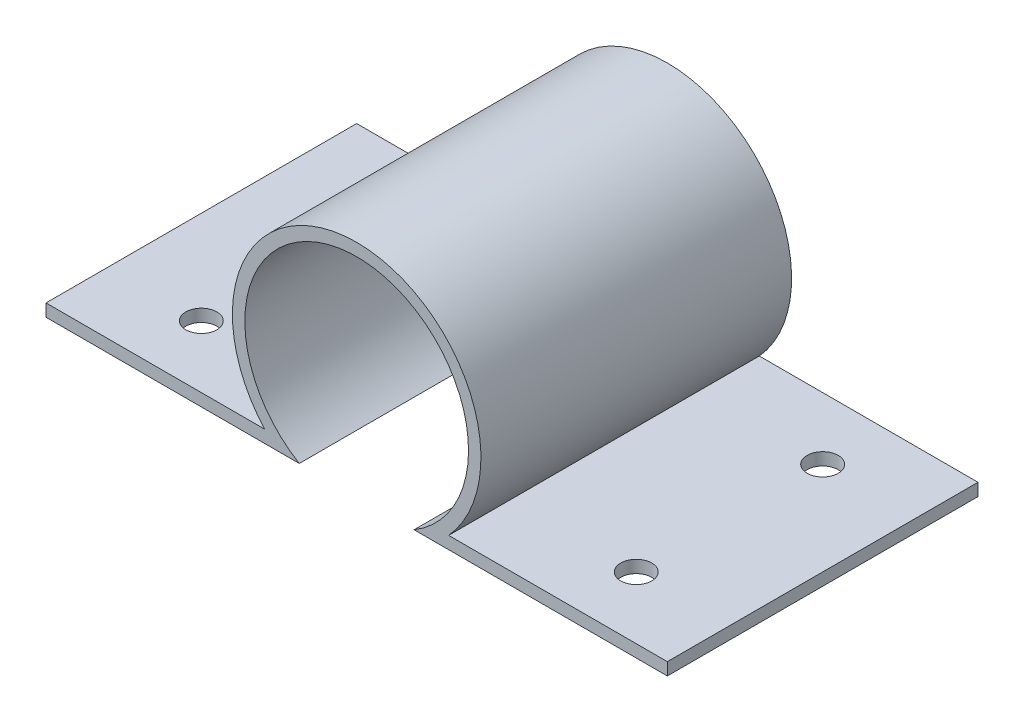
ISO-10303-21;
HEADER;
FILE_DESCRIPTION(('STEP AP214'),'2;1');
FILE_NAME('part.step','',(''),(''),'','','');
FILE_SCHEMA(('AUTOMOTIVE_DESIGN { 1 0 10303 214 1 1 1 1 }'));
ENDSEC;
DATA;
#1=APPLICATION_CONTEXT('core data for automotive mechanical design processes');
#2=APPLICATION_PROTOCOL_DEFINITION('international standard','automotive_design',2000,#1);
#3=PRODUCT_CONTEXT('',#1,'mechanical');
#4=PRODUCT('Part','Part','',(#3));
#5=PRODUCT_RELATED_PRODUCT_CATEGORY('part','',(#4));
#6=PRODUCT_DEFINITION_FORMATION('','',#4);
#7=PRODUCT_DEFINITION_CONTEXT('part definition',#1,'design');
#8=PRODUCT_DEFINITION('design','',#6,#7);
#9=PRODUCT_DEFINITION_SHAPE('','',#8);
#10=(LENGTH_UNIT() NAMED_UNIT(*) SI_UNIT(.MILLI.,.METRE.));
#11=(NAMED_UNIT(*) PLANE_ANGLE_UNIT() SI_UNIT($,.RADIAN.));
#12=(NAMED_UNIT(*) SI_UNIT($,.STERADIAN.) SOLID_ANGLE_UNIT());
#13=UNCERTAINTY_MEASURE_WITH_UNIT(LENGTH_MEASURE(1.E-05),#10,'distance_accuracy_value','');
#14=(GEOMETRIC_REPRESENTATION_CONTEXT(3) GLOBAL_UNCERTAINTY_ASSIGNED_CONTEXT((#13)) GLOBAL_UNIT_ASSIGNED_CONTEXT((#10,
#11,#12)) REPRESENTATION_CONTEXT('',''));
#15=CARTESIAN_POINT('',(0.,0.,0.));
#16=DIRECTION('',(0.,0.,1.));
#17=DIRECTION('',(1.,0.,0.));
#18=AXIS2_PLACEMENT_3D('',#15,#16,#17);
#19=CARTESIAN_POINT('',(-50.,0.,50.));
#20=DIRECTION('',(1.,0.,0.));
#21=DIRECTION('',(0.,0.,-1.));
#22=AXIS2_PLACEMENT_3D('',#19,#20,#21);
#23=PLANE('',#22);
#24=DIRECTION('',(0.,-1.,0.));
#25=VECTOR('',#24,1.);
#26=CARTESIAN_POINT('',(-50.,0.,0.));
#27=LINE('',#26,#25);
#28=CARTESIAN_POINT('',(-50.,0.,0.));
#29=VERTEX_POINT('',#28);
#30=CARTESIAN_POINT('',(-50.,-2.,0.));
#31=VERTEX_POINT('',#30);
#32=EDGE_CURVE('E140',#29,#31,#27,.T.);
#33=ORIENTED_EDGE('',*,*,#32,.T.);
#34=DIRECTION('',(0.,0.,-1.));
#35=VECTOR('',#34,1.);
#36=CARTESIAN_POINT('',(-50.,-2.,50.));
#37=LINE('',#36,#35);
#38=CARTESIAN_POINT('',(-50.,-2.,50.));
#39=VERTEX_POINT('',#38);
#40=EDGE_CURVE('E11',#39,#31,#37,.T.);
#41=ORIENTED_EDGE('',*,*,#40,.F.);
#42=DIRECTION('',(0.,-1.,0.));
#43=VECTOR('',#42,1.);
#44=CARTESIAN_POINT('',(-50.,0.,50.));
#45=LINE('',#44,#43);
#46=CARTESIAN_POINT('',(-50.,0.,50.));
#47=VERTEX_POINT('',#46);
#48=EDGE_CURVE('E163',#47,#39,#45,.T.);
#49=ORIENTED_EDGE('',*,*,#48,.F.);
#50=DIRECTION('',(0.,0.,-1.));
#51=VECTOR('',#50,1.);
#52=CARTESIAN_POINT('',(-50.,0.,50.));
#53=LINE('',#52,#51);
#54=EDGE_CURVE('E136',#47,#29,#53,.T.);
#55=ORIENTED_EDGE('',*,*,#54,.T.);
#56=EDGE_LOOP('',(#33,#41,#49,#55));
#57=FACE_BOUND('',#56,.T.);
#58=ADVANCED_FACE('F39',(#57),#23,.F.);
#59=CARTESIAN_POINT('',(-50.,-2.,50.));
#60=DIRECTION('',(0.,1.,0.));
#61=DIRECTION('',(-1.,0.,0.));
#62=AXIS2_PLACEMENT_3D('',#59,#60,#61);
#63=PLANE('',#62);
#64=CARTESIAN_POINT('',(-35.,-2.,10.));
#65=DIRECTION('',(0.,1.,0.));
#66=DIRECTION('',(-1.,0.,0.));
#67=AXIS2_PLACEMENT_3D('',#64,#65,#66);
#68=CIRCLE('',#67,2.5);
#69=CARTESIAN_POINT('',(-37.5,-2.,10.));
#70=VERTEX_POINT('',#69);
#71=EDGE_CURVE('E214',#70,#70,#68,.T.);
#72=ORIENTED_EDGE('',*,*,#71,.T.);
#73=EDGE_LOOP('',(#72));
#74=FACE_BOUND('',#73,.T.);
#75=CARTESIAN_POINT('',(-35.,-2.,40.));
#76=DIRECTION('',(0.,1.,0.));
#77=DIRECTION('',(-1.,0.,0.));
#78=AXIS2_PLACEMENT_3D('',#75,#76,#77);
#79=CIRCLE('',#78,2.5);
#80=CARTESIAN_POINT('',(-37.5,-2.,40.));
#81=VERTEX_POINT('',#80);
#82=EDGE_CURVE('E218',#81,#81,#79,.T.);
#83=ORIENTED_EDGE('',*,*,#82,.T.);
#84=EDGE_LOOP('',(#83));
#85=FACE_BOUND('',#84,.T.);
#86=DIRECTION('',(1.,0.,0.));
#87=VECTOR('',#86,1.);
#88=CARTESIAN_POINT('',(-50.,-2.,0.));
#89=LINE('',#88,#87);
#90=CARTESIAN_POINT('',(-9.23825219636957,-1.99999999999999,0.));
#91=VERTEX_POINT('',#90);
#92=EDGE_CURVE('E144',#31,#91,#89,.T.);
#93=ORIENTED_EDGE('',*,*,#92,.T.);
#94=DIRECTION('',(0.,0.,-1.));
#95=VECTOR('',#94,1.);
#96=CARTESIAN_POINT('',(-9.23825219636957,-1.99999999999999,50.));
#97=LINE('',#96,#95);
#98=CARTESIAN_POINT('',(-9.23825219636957,-1.99999999999999,50.));
#99=VERTEX_POINT('',#98);
#100=EDGE_CURVE('E48',#99,#91,#97,.T.);
#101=ORIENTED_EDGE('',*,*,#100,.F.);
#102=DIRECTION('',(1.,0.,0.));
#103=VECTOR('',#102,1.);
#104=CARTESIAN_POINT('',(-50.,-2.,50.));
#105=LINE('',#104,#103);
#106=EDGE_CURVE('E99',#39,#99,#105,.T.);
#107=ORIENTED_EDGE('',*,*,#106,.F.);
#108=ORIENTED_EDGE('',*,*,#40,.T.);
#109=EDGE_LOOP('',(#93,#101,#107,#108));
#110=FACE_BOUND('',#109,.T.);
#111=ADVANCED_FACE('F262',(#74,#85,#110),#63,.F.);
#112=CARTESIAN_POINT('',(0.,13.4484528790514,50.));
#113=DIRECTION('',(0.,0.,-1.));
#114=DIRECTION('',(-1.,0.,0.));
#115=AXIS2_PLACEMENT_3D('',#112,#113,#114);
#116=CYLINDRICAL_SURFACE('',#115,18.);
#117=CARTESIAN_POINT('',(0.,13.4484528790514,0.));
#118=DIRECTION('',(0.,0.,-1.));
#119=DIRECTION('',(1.,0.,0.));
#120=AXIS2_PLACEMENT_3D('',#117,#118,#119);
#121=CIRCLE('',#120,18.);
#122=CARTESIAN_POINT('',(9.23825219636958,-2.,0.));
#123=VERTEX_POINT('',#122);
#124=EDGE_CURVE('E148',#91,#123,#121,.T.);
#125=ORIENTED_EDGE('',*,*,#124,.T.);
#126=DIRECTION('',(0.,0.,-1.));
#127=VECTOR('',#126,1.);
#128=CARTESIAN_POINT('',(9.23825219636958,-2.,50.));
#129=LINE('',#128,#127);
#130=CARTESIAN_POINT('',(9.23825219636958,-2.,50.));
#131=VERTEX_POINT('',#130);
#132=EDGE_CURVE('E174',#131,#123,#129,.T.);
#133=ORIENTED_EDGE('',*,*,#132,.F.);
#134=CARTESIAN_POINT('',(0.,13.4484528790514,50.));
#135=DIRECTION('',(0.,0.,-1.));
#136=DIRECTION('',(1.,0.,0.));
#137=AXIS2_PLACEMENT_3D('',#134,#135,#136);
#138=CIRCLE('',#137,18.);
#139=EDGE_CURVE('E184',#99,#131,#138,.T.);
#140=ORIENTED_EDGE('',*,*,#139,.F.);
#141=ORIENTED_EDGE('',*,*,#100,.T.);
#142=EDGE_LOOP('',(#125,#133,#140,#141));
#143=FACE_BOUND('',#142,.T.);
#144=ADVANCED_FACE('F182',(#143),#116,.F.);
#145=CARTESIAN_POINT('',(9.23825219636958,-2.,50.));
#146=DIRECTION('',(0.,1.,0.));
#147=DIRECTION('',(-1.,0.,0.));
#148=AXIS2_PLACEMENT_3D('',#145,#146,#147);
#149=PLANE('',#148);
#150=CARTESIAN_POINT('',(35.,-1.99999999999999,40.));
#151=DIRECTION('',(0.,1.,0.));
#152=DIRECTION('',(-1.,0.,0.));
#153=AXIS2_PLACEMENT_3D('',#150,#151,#152);
#154=CIRCLE('',#153,2.5);
#155=CARTESIAN_POINT('',(32.5,-1.99999999999999,40.));
#156=VERTEX_POINT('',#155);
#157=EDGE_CURVE('E145',#156,#156,#154,.T.);
#158=ORIENTED_EDGE('',*,*,#157,.T.);
#159=EDGE_LOOP('',(#158));
#160=FACE_BOUND('',#159,.T.);
#161=CARTESIAN_POINT('',(35.,-1.99999999999999,10.));
#162=DIRECTION('',(0.,1.,0.));
#163=DIRECTION('',(-1.,0.,0.));
#164=AXIS2_PLACEMENT_3D('',#161,#162,#163);
#165=CIRCLE('',#164,2.5);
#166=CARTESIAN_POINT('',(32.5,-1.99999999999999,10.));
#167=VERTEX_POINT('',#166);
#168=EDGE_CURVE('E210',#167,#167,#165,.T.);
#169=ORIENTED_EDGE('',*,*,#168,.T.);
#170=EDGE_LOOP('',(#169));
#171=FACE_BOUND('',#170,.T.);
#172=DIRECTION('',(1.,0.,0.));
#173=VECTOR('',#172,1.);
#174=CARTESIAN_POINT('',(9.23825219636958,-2.,0.));
#175=LINE('',#174,#173);
#176=CARTESIAN_POINT('',(50.,-2.,0.));
#177=VERTEX_POINT('',#176);
#178=EDGE_CURVE('E151',#123,#177,#175,.T.);
#179=ORIENTED_EDGE('',*,*,#178,.T.);
#180=DIRECTION('',(0.,0.,-1.));
#181=VECTOR('',#180,1.);
#182=CARTESIAN_POINT('',(50.,-2.,50.));
#183=LINE('',#182,#181);
#184=CARTESIAN_POINT('',(50.,-2.,50.));
#185=VERTEX_POINT('',#184);
#186=EDGE_CURVE('E170',#185,#177,#183,.T.);
#187=ORIENTED_EDGE('',*,*,#186,.F.);
#188=DIRECTION('',(1.,0.,0.));
#189=VECTOR('',#188,1.);
#190=CARTESIAN_POINT('',(9.23825219636958,-2.,50.));
#191=LINE('',#190,#189);
#192=EDGE_CURVE('E197',#131,#185,#191,.T.);
#193=ORIENTED_EDGE('',*,*,#192,.F.);
#194=ORIENTED_EDGE('',*,*,#132,.T.);
#195=EDGE_LOOP('',(#179,#187,#193,#194));
#196=FACE_BOUND('',#195,.T.);
#197=ADVANCED_FACE('F192',(#160,#171,#196),#149,.F.);
#198=CARTESIAN_POINT('',(50.,0.,50.));
#199=DIRECTION('',(-1.,0.,0.));
#200=DIRECTION('',(0.,0.,1.));
#201=AXIS2_PLACEMENT_3D('',#198,#199,#200);
#202=PLANE('',#201);
#203=DIRECTION('',(0.,1.,0.));
#204=VECTOR('',#203,1.);
#205=CARTESIAN_POINT('',(50.,0.,0.));
#206=LINE('',#205,#204);
#207=CARTESIAN_POINT('',(50.,0.,0.));
#208=VERTEX_POINT('',#207);
#209=EDGE_CURVE('E154',#177,#208,#206,.T.);
#210=ORIENTED_EDGE('',*,*,#209,.T.);
#211=DIRECTION('',(0.,0.,-1.));
#212=VECTOR('',#211,1.);
#213=CARTESIAN_POINT('',(50.,0.,50.));
#214=LINE('',#213,#212);
#215=CARTESIAN_POINT('',(50.,0.,50.));
#216=VERTEX_POINT('',#215);
#217=EDGE_CURVE('E129',#216,#208,#214,.T.);
#218=ORIENTED_EDGE('',*,*,#217,.F.);
#219=DIRECTION('',(0.,1.,0.));
#220=VECTOR('',#219,1.);
#221=CARTESIAN_POINT('',(50.,0.,50.));
#222=LINE('',#221,#220);
#223=EDGE_CURVE('E118',#185,#216,#222,.T.);
#224=ORIENTED_EDGE('',*,*,#223,.F.);
#225=ORIENTED_EDGE('',*,*,#186,.T.);
#226=EDGE_LOOP('',(#210,#218,#224,#225));
#227=FACE_BOUND('',#226,.T.);
#228=ADVANCED_FACE('F195',(#227),#202,.F.);
#229=CARTESIAN_POINT('',(14.8033481064229,0.,50.));
#230=DIRECTION('',(0.,-1.,0.));
#231=DIRECTION('',(1.,0.,0.));
#232=AXIS2_PLACEMENT_3D('',#229,#230,#231);
#233=PLANE('',#232);
#234=CARTESIAN_POINT('',(35.,0.,40.));
#235=DIRECTION('',(0.,1.,0.));
#236=DIRECTION('',(1.,0.,0.));
#237=AXIS2_PLACEMENT_3D('',#234,#235,#236);
#238=CIRCLE('',#237,2.5);
#239=CARTESIAN_POINT('',(37.5,0.,40.));
#240=VERTEX_POINT('',#239);
#241=EDGE_CURVE('E226',#240,#240,#238,.T.);
#242=ORIENTED_EDGE('',*,*,#241,.F.);
#243=EDGE_LOOP('',(#242));
#244=FACE_BOUND('',#243,.T.);
#245=CARTESIAN_POINT('',(35.,0.,10.));
#246=DIRECTION('',(0.,1.,0.));
#247=DIRECTION('',(-1.,0.,0.));
#248=AXIS2_PLACEMENT_3D('',#245,#246,#247);
#249=CIRCLE('',#248,2.5);
#250=CARTESIAN_POINT('',(32.5,0.,10.));
#251=VERTEX_POINT('',#250);
#252=EDGE_CURVE('E222',#251,#251,#249,.T.);
#253=ORIENTED_EDGE('',*,*,#252,.F.);
#254=EDGE_LOOP('',(#253));
#255=FACE_BOUND('',#254,.T.);
#256=DIRECTION('',(-1.,0.,0.));
#257=VECTOR('',#256,1.);
#258=CARTESIAN_POINT('',(14.8033481064229,0.,0.));
#259=LINE('',#258,#257);
#260=CARTESIAN_POINT('',(14.8033481064228,0.,0.));
#261=VERTEX_POINT('',#260);
#262=EDGE_CURVE('E127',#208,#261,#259,.T.);
#263=ORIENTED_EDGE('',*,*,#262,.T.);
#264=DIRECTION('',(0.,0.,-1.));
#265=VECTOR('',#264,1.);
#266=CARTESIAN_POINT('',(14.8033481064228,0.,50.));
#267=LINE('',#266,#265);
#268=CARTESIAN_POINT('',(14.8033481064228,0.,50.));
#269=VERTEX_POINT('',#268);
#270=EDGE_CURVE('E124',#269,#261,#267,.T.);
#271=ORIENTED_EDGE('',*,*,#270,.F.);
#272=DIRECTION('',(-1.,0.,0.));
#273=VECTOR('',#272,1.);
#274=CARTESIAN_POINT('',(14.8033481064229,0.,50.));
#275=LINE('',#274,#273);
#276=EDGE_CURVE('E112',#216,#269,#275,.T.);
#277=ORIENTED_EDGE('',*,*,#276,.F.);
#278=ORIENTED_EDGE('',*,*,#217,.T.);
#279=EDGE_LOOP('',(#263,#271,#277,#278));
#280=FACE_BOUND('',#279,.T.);
#281=ADVANCED_FACE('F125',(#244,#255,#280),#233,.F.);
#282=CARTESIAN_POINT('',(0.,13.4484528790514,50.));
#283=DIRECTION('',(0.,0.,-1.));
#284=DIRECTION('',(-1.,0.,0.));
#285=AXIS2_PLACEMENT_3D('',#282,#283,#284);
#286=CYLINDRICAL_SURFACE('',#285,20.);
#287=CARTESIAN_POINT('',(0.,13.4484528790514,0.));
#288=DIRECTION('',(0.,0.,1.));
#289=DIRECTION('',(1.,0.,0.));
#290=AXIS2_PLACEMENT_3D('',#287,#288,#289);
#291=CIRCLE('',#290,20.);
#292=CARTESIAN_POINT('',(-14.8033481064228,0.,0.));
#293=VERTEX_POINT('',#292);
#294=EDGE_CURVE('E85',#261,#293,#291,.T.);
#295=ORIENTED_EDGE('',*,*,#294,.T.);
#296=DIRECTION('',(0.,0.,-1.));
#297=VECTOR('',#296,1.);
#298=CARTESIAN_POINT('',(-14.8033481064228,0.,50.));
#299=LINE('',#298,#297);
#300=CARTESIAN_POINT('',(-14.8033481064228,0.,50.));
#301=VERTEX_POINT('',#300);
#302=EDGE_CURVE('E130',#301,#293,#299,.T.);
#303=ORIENTED_EDGE('',*,*,#302,.F.);
#304=CARTESIAN_POINT('',(0.,13.4484528790514,50.));
#305=DIRECTION('',(0.,0.,1.));
#306=DIRECTION('',(1.,0.,0.));
#307=AXIS2_PLACEMENT_3D('',#304,#305,#306);
#308=CIRCLE('',#307,20.);
#309=EDGE_CURVE('E116',#269,#301,#308,.T.);
#310=ORIENTED_EDGE('',*,*,#309,.F.);
#311=ORIENTED_EDGE('',*,*,#270,.T.);
#312=EDGE_LOOP('',(#295,#303,#310,#311));
#313=FACE_BOUND('',#312,.T.);
#314=ADVANCED_FACE('F132',(#313),#286,.T.);
#315=CARTESIAN_POINT('',(-50.,0.,50.));
#316=DIRECTION('',(0.,-1.,0.));
#317=DIRECTION('',(0.,0.,-1.));
#318=AXIS2_PLACEMENT_3D('',#315,#316,#317);
#319=PLANE('',#318);
#320=CARTESIAN_POINT('',(-35.,0.,10.));
#321=DIRECTION('',(0.,1.,0.));
#322=DIRECTION('',(1.,0.,0.));
#323=AXIS2_PLACEMENT_3D('',#320,#321,#322);
#324=CIRCLE('',#323,2.5);
#325=CARTESIAN_POINT('',(-32.5,0.,10.));
#326=VERTEX_POINT('',#325);
#327=EDGE_CURVE('E227',#326,#326,#324,.T.);
#328=ORIENTED_EDGE('',*,*,#327,.F.);
#329=EDGE_LOOP('',(#328));
#330=FACE_BOUND('',#329,.T.);
#331=CARTESIAN_POINT('',(-35.,0.,40.));
#332=DIRECTION('',(0.,1.,0.));
#333=DIRECTION('',(-1.,0.,0.));
#334=AXIS2_PLACEMENT_3D('',#331,#332,#333);
#335=CIRCLE('',#334,2.5);
#336=CARTESIAN_POINT('',(-37.5,0.,40.));
#337=VERTEX_POINT('',#336);
#338=EDGE_CURVE('E231',#337,#337,#335,.T.);
#339=ORIENTED_EDGE('',*,*,#338,.F.);
#340=EDGE_LOOP('',(#339));
#341=FACE_BOUND('',#340,.T.);
#342=DIRECTION('',(-1.,0.,0.));
#343=VECTOR('',#342,1.);
#344=CARTESIAN_POINT('',(-50.,0.,0.));
#345=LINE('',#344,#343);
#346=EDGE_CURVE('E91',#293,#29,#345,.T.);
#347=ORIENTED_EDGE('',*,*,#346,.T.);
#348=ORIENTED_EDGE('',*,*,#54,.F.);
#349=DIRECTION('',(-1.,0.,0.));
#350=VECTOR('',#349,1.);
#351=CARTESIAN_POINT('',(-50.,0.,50.));
#352=LINE('',#351,#350);
#353=EDGE_CURVE('E56',#301,#47,#352,.T.);
#354=ORIENTED_EDGE('',*,*,#353,.F.);
#355=ORIENTED_EDGE('',*,*,#302,.T.);
#356=EDGE_LOOP('',(#347,#348,#354,#355));
#357=FACE_BOUND('',#356,.T.);
#358=ADVANCED_FACE('F272',(#330,#341,#357),#319,.F.);
#359=CARTESIAN_POINT('',(0.,13.4484528790514,50.));
#360=DIRECTION('',(0.,0.,1.));
#361=DIRECTION('',(1.,0.,0.));
#362=AXIS2_PLACEMENT_3D('',#359,#360,#361);
#363=PLANE('',#362);
#364=ORIENTED_EDGE('',*,*,#48,.T.);
#365=ORIENTED_EDGE('',*,*,#106,.T.);
#366=ORIENTED_EDGE('',*,*,#139,.T.);
#367=ORIENTED_EDGE('',*,*,#192,.T.);
#368=ORIENTED_EDGE('',*,*,#223,.T.);
#369=ORIENTED_EDGE('',*,*,#276,.T.);
#370=ORIENTED_EDGE('',*,*,#309,.T.);
#371=ORIENTED_EDGE('',*,*,#353,.T.);
#372=EDGE_LOOP('',(#364,#365,#366,#367,#368,#369,#370,#371));
#373=FACE_BOUND('',#372,.T.);
#374=ADVANCED_FACE('F114',(#373),#363,.T.);
#375=CARTESIAN_POINT('',(0.,13.4484528790514,0.));
#376=DIRECTION('',(0.,0.,1.));
#377=DIRECTION('',(1.,0.,0.));
#378=AXIS2_PLACEMENT_3D('',#375,#376,#377);
#379=PLANE('',#378);
#380=ORIENTED_EDGE('',*,*,#32,.F.);
#381=ORIENTED_EDGE('',*,*,#346,.F.);
#382=ORIENTED_EDGE('',*,*,#294,.F.);
#383=ORIENTED_EDGE('',*,*,#262,.F.);
#384=ORIENTED_EDGE('',*,*,#209,.F.);
#385=ORIENTED_EDGE('',*,*,#178,.F.);
#386=ORIENTED_EDGE('',*,*,#124,.F.);
#387=ORIENTED_EDGE('',*,*,#92,.F.);
#388=EDGE_LOOP('',(#380,#381,#382,#383,#384,#385,#386,#387));
#389=FACE_BOUND('',#388,.T.);
#390=ADVANCED_FACE('F188',(#389),#379,.F.);
#391=CARTESIAN_POINT('',(-35.,-50.,40.));
#392=DIRECTION('',(0.,1.,0.));
#393=DIRECTION('',(-1.,0.,0.));
#394=AXIS2_PLACEMENT_3D('',#391,#392,#393);
#395=CYLINDRICAL_SURFACE('',#394,2.5);
#396=ORIENTED_EDGE('',*,*,#338,.T.);
#397=EDGE_LOOP('',(#396));
#398=FACE_BOUND('',#397,.T.);
#399=ORIENTED_EDGE('',*,*,#82,.F.);
#400=EDGE_LOOP('',(#399));
#401=FACE_BOUND('',#400,.T.);
#402=ADVANCED_FACE('F286',(#398,#401),#395,.F.);
#403=CARTESIAN_POINT('',(-35.,-50.,10.));
#404=DIRECTION('',(0.,1.,0.));
#405=DIRECTION('',(-1.,0.,0.));
#406=AXIS2_PLACEMENT_3D('',#403,#404,#405);
#407=CYLINDRICAL_SURFACE('',#406,2.5);
#408=ORIENTED_EDGE('',*,*,#327,.T.);
#409=EDGE_LOOP('',(#408));
#410=FACE_BOUND('',#409,.T.);
#411=ORIENTED_EDGE('',*,*,#71,.F.);
#412=EDGE_LOOP('',(#411));
#413=FACE_BOUND('',#412,.T.);
#414=ADVANCED_FACE('F250',(#410,#413),#407,.F.);
#415=CARTESIAN_POINT('',(35.,-50.,10.));
#416=DIRECTION('',(0.,1.,0.));
#417=DIRECTION('',(-1.,0.,0.));
#418=AXIS2_PLACEMENT_3D('',#415,#416,#417);
#419=CYLINDRICAL_SURFACE('',#418,2.5);
#420=ORIENTED_EDGE('',*,*,#252,.T.);
#421=EDGE_LOOP('',(#420));
#422=FACE_BOUND('',#421,.T.);
#423=ORIENTED_EDGE('',*,*,#168,.F.);
#424=EDGE_LOOP('',(#423));
#425=FACE_BOUND('',#424,.T.);
#426=ADVANCED_FACE('F247',(#422,#425),#419,.F.);
#427=CARTESIAN_POINT('',(35.,-50.,40.));
#428=DIRECTION('',(0.,1.,0.));
#429=DIRECTION('',(-1.,0.,0.));
#430=AXIS2_PLACEMENT_3D('',#427,#428,#429);
#431=CYLINDRICAL_SURFACE('',#430,2.5);
#432=ORIENTED_EDGE('',*,*,#241,.T.);
#433=EDGE_LOOP('',(#432));
#434=FACE_BOUND('',#433,.T.);
#435=ORIENTED_EDGE('',*,*,#157,.F.);
#436=EDGE_LOOP('',(#435));
#437=FACE_BOUND('',#436,.T.);
#438=ADVANCED_FACE('F239',(#434,#437),#431,.F.);
#439=CLOSED_SHELL('',(#58,#111,#144,#197,#228,#281,#314,#358,#374,#390,#402,#414,#426,#438));
#440=MANIFOLD_SOLID_BREP('B2',#439);
#441=ADVANCED_BREP_SHAPE_REPRESENTATION('',(#18,#440),#14);
#442=SHAPE_DEFINITION_REPRESENTATION(#9,#441);
ENDSEC;
END-ISO-10303-21;
